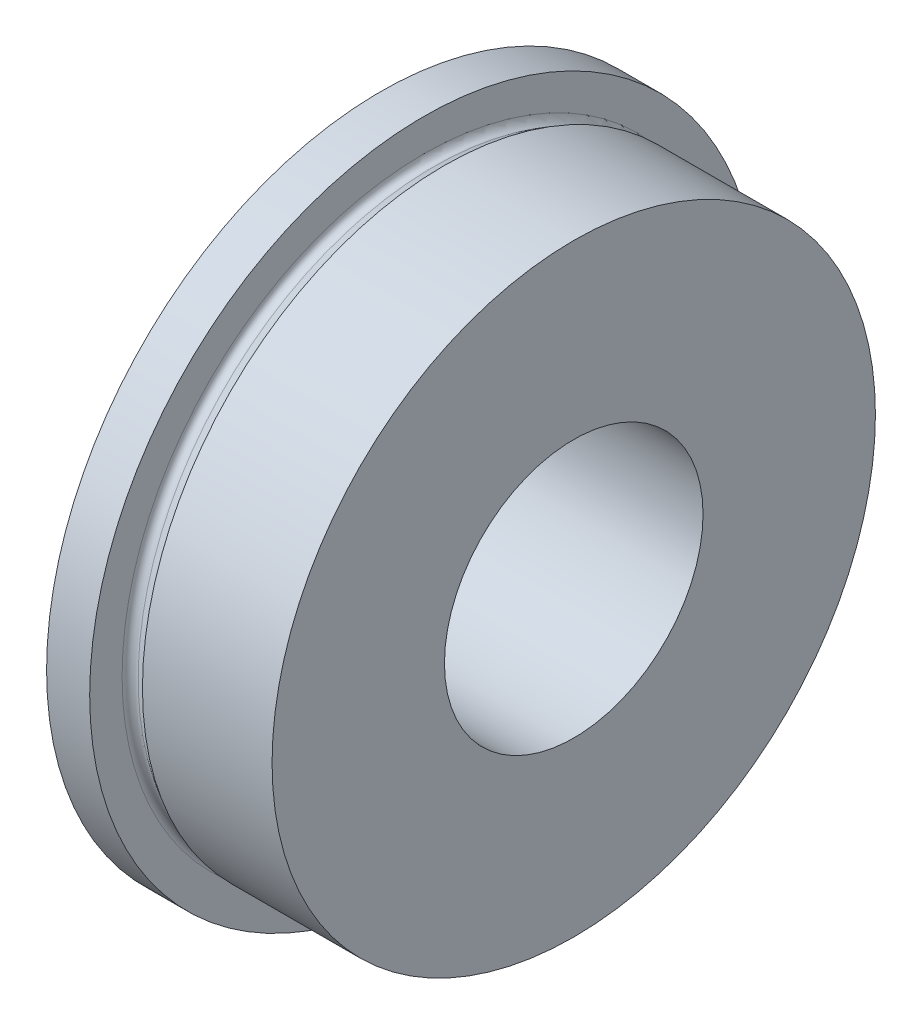
ISO-10303-21;
HEADER;
FILE_DESCRIPTION(('STEP AP214'),'2;1');
FILE_NAME('part.step','',(''),(''),'','','');
FILE_SCHEMA(('AUTOMOTIVE_DESIGN { 1 0 10303 214 1 1 1 1 }'));
ENDSEC;
DATA;
#1=APPLICATION_CONTEXT('core data for automotive mechanical design processes');
#2=APPLICATION_PROTOCOL_DEFINITION('international standard','automotive_design',2000,#1);
#3=PRODUCT_CONTEXT('',#1,'mechanical');
#4=PRODUCT('Part','Part','',(#3));
#5=PRODUCT_RELATED_PRODUCT_CATEGORY('part','',(#4));
#6=PRODUCT_DEFINITION_FORMATION('','',#4);
#7=PRODUCT_DEFINITION_CONTEXT('part definition',#1,'design');
#8=PRODUCT_DEFINITION('design','',#6,#7);
#9=PRODUCT_DEFINITION_SHAPE('','',#8);
#10=(LENGTH_UNIT() NAMED_UNIT(*) SI_UNIT(.MILLI.,.METRE.));
#11=(NAMED_UNIT(*) PLANE_ANGLE_UNIT() SI_UNIT($,.RADIAN.));
#12=(NAMED_UNIT(*) SI_UNIT($,.STERADIAN.) SOLID_ANGLE_UNIT());
#13=UNCERTAINTY_MEASURE_WITH_UNIT(LENGTH_MEASURE(1.E-05),#10,'distance_accuracy_value','');
#14=(GEOMETRIC_REPRESENTATION_CONTEXT(3) GLOBAL_UNCERTAINTY_ASSIGNED_CONTEXT((#13)) GLOBAL_UNIT_ASSIGNED_CONTEXT((#10,
#11,#12)) REPRESENTATION_CONTEXT('',''));
#15=CARTESIAN_POINT('',(0.,0.,0.));
#16=DIRECTION('',(0.,0.,1.));
#17=DIRECTION('',(1.,0.,0.));
#18=AXIS2_PLACEMENT_3D('',#15,#16,#17);
#19=CARTESIAN_POINT('',(0.,0.,0.));
#20=DIRECTION('',(-1.,0.,0.));
#21=DIRECTION('',(0.,0.,1.));
#22=AXIS2_PLACEMENT_3D('',#19,#20,#21);
#23=CYLINDRICAL_SURFACE('',#22,12.3063);
#24=CARTESIAN_POINT('',(0.,0.,0.));
#25=DIRECTION('',(-1.,0.,0.));
#26=DIRECTION('',(0.,0.,1.));
#27=AXIS2_PLACEMENT_3D('',#24,#25,#26);
#28=CIRCLE('',#27,12.3063);
#29=CARTESIAN_POINT('',(0.,0.,12.3063));
#30=VERTEX_POINT('',#29);
#31=EDGE_CURVE('E95',#30,#30,#28,.F.);
#32=ORIENTED_EDGE('',*,*,#31,.T.);
#33=EDGE_LOOP('',(#32));
#34=FACE_BOUND('',#33,.T.);
#35=CARTESIAN_POINT('',(1.5875,0.,0.));
#36=DIRECTION('',(-1.,0.,0.));
#37=DIRECTION('',(0.,0.,1.));
#38=AXIS2_PLACEMENT_3D('',#35,#36,#37);
#39=CIRCLE('',#38,12.3063);
#40=CARTESIAN_POINT('',(1.5875,0.,12.3063));
#41=VERTEX_POINT('',#40);
#42=EDGE_CURVE('E93',#41,#41,#39,.T.);
#43=ORIENTED_EDGE('',*,*,#42,.T.);
#44=EDGE_LOOP('',(#43));
#45=FACE_BOUND('',#44,.T.);
#46=ADVANCED_FACE('F16',(#34,#45),#23,.T.);
#47=CARTESIAN_POINT('',(0.,12.3063,0.));
#48=DIRECTION('',(1.,0.,0.));
#49=DIRECTION('',(0.,0.,-1.));
#50=AXIS2_PLACEMENT_3D('',#47,#48,#49);
#51=PLANE('',#50);
#52=ORIENTED_EDGE('',*,*,#31,.F.);
#53=EDGE_LOOP('',(#52));
#54=FACE_BOUND('',#53,.T.);
#55=CARTESIAN_POINT('',(0.,0.,0.));
#56=DIRECTION('',(-1.,0.,0.));
#57=DIRECTION('',(0.,0.,1.));
#58=AXIS2_PLACEMENT_3D('',#55,#56,#57);
#59=CIRCLE('',#58,9.906);
#60=CARTESIAN_POINT('',(0.,0.,9.906));
#61=VERTEX_POINT('',#60);
#62=EDGE_CURVE('E47',#61,#61,#59,.F.);
#63=ORIENTED_EDGE('',*,*,#62,.T.);
#64=EDGE_LOOP('',(#63));
#65=FACE_BOUND('',#64,.T.);
#66=ADVANCED_FACE('F65',(#54,#65),#51,.F.);
#67=CARTESIAN_POINT('',(1.5875,11.1125,0.));
#68=DIRECTION('',(-1.,0.,0.));
#69=DIRECTION('',(0.,0.,1.));
#70=AXIS2_PLACEMENT_3D('',#67,#68,#69);
#71=PLANE('',#70);
#72=CARTESIAN_POINT('',(1.5875,0.,0.));
#73=DIRECTION('',(1.,0.,0.));
#74=DIRECTION('',(0.,0.,1.));
#75=AXIS2_PLACEMENT_3D('',#72,#73,#74);
#76=CIRCLE('',#75,11.1125);
#77=CARTESIAN_POINT('',(1.5875,0.,-11.1125));
#78=VERTEX_POINT('',#77);
#79=CARTESIAN_POINT('',(1.5875,0.,11.1125));
#80=VERTEX_POINT('',#79);
#81=EDGE_CURVE('E33',#78,#80,#76,.F.);
#82=ORIENTED_EDGE('',*,*,#81,.T.);
#83=CARTESIAN_POINT('',(1.5875,0.,0.));
#84=DIRECTION('',(1.,0.,0.));
#85=DIRECTION('',(0.,0.,-1.));
#86=AXIS2_PLACEMENT_3D('',#83,#84,#85);
#87=CIRCLE('',#86,11.1125);
#88=EDGE_CURVE('E35',#80,#78,#87,.F.);
#89=ORIENTED_EDGE('',*,*,#88,.T.);
#90=EDGE_LOOP('',(#82,#89));
#91=FACE_BOUND('',#90,.T.);
#92=ORIENTED_EDGE('',*,*,#42,.F.);
#93=EDGE_LOOP('',(#92));
#94=FACE_BOUND('',#93,.T.);
#95=ADVANCED_FACE('F45',(#91,#94),#71,.F.);
#96=CARTESIAN_POINT('',(0.,0.,0.));
#97=DIRECTION('',(-1.,0.,0.));
#98=DIRECTION('',(0.,0.,1.));
#99=AXIS2_PLACEMENT_3D('',#96,#97,#98);
#100=CYLINDRICAL_SURFACE('',#99,9.906);
#101=CARTESIAN_POINT('',(0.381,0.,0.));
#102=DIRECTION('',(-1.,0.,0.));
#103=DIRECTION('',(0.,0.,1.));
#104=AXIS2_PLACEMENT_3D('',#101,#102,#103);
#105=CIRCLE('',#104,9.906);
#106=CARTESIAN_POINT('',(0.381,0.,9.906));
#107=VERTEX_POINT('',#106);
#108=EDGE_CURVE('E41',#107,#107,#105,.F.);
#109=ORIENTED_EDGE('',*,*,#108,.T.);
#110=EDGE_LOOP('',(#109));
#111=FACE_BOUND('',#110,.T.);
#112=ORIENTED_EDGE('',*,*,#62,.F.);
#113=EDGE_LOOP('',(#112));
#114=FACE_BOUND('',#113,.T.);
#115=ADVANCED_FACE('F64',(#111,#114),#100,.F.);
#116=CARTESIAN_POINT('',(0.381,9.906,0.));
#117=DIRECTION('',(1.,0.,0.));
#118=DIRECTION('',(0.,0.,-1.));
#119=AXIS2_PLACEMENT_3D('',#116,#117,#118);
#120=PLANE('',#119);
#121=ORIENTED_EDGE('',*,*,#108,.F.);
#122=EDGE_LOOP('',(#121));
#123=FACE_BOUND('',#122,.T.);
#124=CARTESIAN_POINT('',(0.381,0.,0.));
#125=DIRECTION('',(-1.,0.,0.));
#126=DIRECTION('',(0.,0.,1.));
#127=AXIS2_PLACEMENT_3D('',#124,#125,#126);
#128=CIRCLE('',#127,6.35);
#129=CARTESIAN_POINT('',(0.381,0.,6.35));
#130=VERTEX_POINT('',#129);
#131=EDGE_CURVE('E86',#130,#130,#128,.T.);
#132=ORIENTED_EDGE('',*,*,#131,.F.);
#133=EDGE_LOOP('',(#132));
#134=FACE_BOUND('',#133,.T.);
#135=ADVANCED_FACE('F106',(#123,#134),#120,.F.);
#136=CARTESIAN_POINT('',(1.8375,0.,0.));
#137=DIRECTION('',(-1.,0.,0.));
#138=DIRECTION('',(0.,0.,1.));
#139=AXIS2_PLACEMENT_3D('',#136,#137,#138);
#140=TOROIDAL_SURFACE('',#139,11.1125,0.250000000000001);
#141=ORIENTED_EDGE('',*,*,#88,.F.);
#142=ORIENTED_EDGE('',*,*,#81,.F.);
#143=EDGE_LOOP('',(#141,#142));
#144=FACE_BOUND('',#143,.T.);
#145=CARTESIAN_POINT('',(1.9625,0.,0.));
#146=DIRECTION('',(1.,0.,0.));
#147=DIRECTION('',(0.,0.,-1.));
#148=AXIS2_PLACEMENT_3D('',#145,#146,#147);
#149=CIRCLE('',#148,10.8959936490539);
#150=CARTESIAN_POINT('',(1.9625,0.,-10.8959936490539));
#151=VERTEX_POINT('',#150);
#152=EDGE_CURVE('E85',#151,#151,#149,.T.);
#153=ORIENTED_EDGE('',*,*,#152,.F.);
#154=EDGE_LOOP('',(#153));
#155=FACE_BOUND('',#154,.T.);
#156=ADVANCED_FACE('F37',(#144,#155),#140,.F.);
#157=CARTESIAN_POINT('',(0.,0.,0.));
#158=DIRECTION('',(-1.,0.,0.));
#159=DIRECTION('',(0.,0.,1.));
#160=AXIS2_PLACEMENT_3D('',#157,#158,#159);
#161=CYLINDRICAL_SURFACE('',#160,6.35);
#162=CARTESIAN_POINT('',(0.,0.,0.));
#163=DIRECTION('',(-1.,0.,0.));
#164=DIRECTION('',(0.,0.,1.));
#165=AXIS2_PLACEMENT_3D('',#162,#163,#164);
#166=CIRCLE('',#165,6.35);
#167=CARTESIAN_POINT('',(0.,0.,6.35));
#168=VERTEX_POINT('',#167);
#169=EDGE_CURVE('E82',#168,#168,#166,.F.);
#170=ORIENTED_EDGE('',*,*,#169,.T.);
#171=EDGE_LOOP('',(#170));
#172=FACE_BOUND('',#171,.T.);
#173=ORIENTED_EDGE('',*,*,#131,.T.);
#174=EDGE_LOOP('',(#173));
#175=FACE_BOUND('',#174,.T.);
#176=ADVANCED_FACE('F137',(#172,#175),#161,.T.);
#177=CARTESIAN_POINT('',(2.3375,0.,0.));
#178=DIRECTION('',(1.,0.,0.));
#179=DIRECTION('',(0.,0.,-1.));
#180=AXIS2_PLACEMENT_3D('',#177,#178,#179);
#181=CONICAL_SURFACE('',#180,11.1125,0.523598775598302);
#182=CARTESIAN_POINT('',(2.3375,0.,0.));
#183=DIRECTION('',(-1.,0.,0.));
#184=DIRECTION('',(0.,0.,1.));
#185=AXIS2_PLACEMENT_3D('',#182,#183,#184);
#186=CIRCLE('',#185,11.1125);
#187=CARTESIAN_POINT('',(2.3375,0.,11.1125));
#188=VERTEX_POINT('',#187);
#189=EDGE_CURVE('E81',#188,#188,#186,.F.);
#190=ORIENTED_EDGE('',*,*,#189,.F.);
#191=EDGE_LOOP('',(#190));
#192=FACE_BOUND('',#191,.T.);
#193=ORIENTED_EDGE('',*,*,#152,.T.);
#194=EDGE_LOOP('',(#193));
#195=FACE_BOUND('',#194,.T.);
#196=ADVANCED_FACE('F133',(#192,#195),#181,.T.);
#197=CARTESIAN_POINT('',(0.,6.35,0.));
#198=DIRECTION('',(1.,0.,0.));
#199=DIRECTION('',(0.,0.,-1.));
#200=AXIS2_PLACEMENT_3D('',#197,#198,#199);
#201=PLANE('',#200);
#202=ORIENTED_EDGE('',*,*,#169,.F.);
#203=EDGE_LOOP('',(#202));
#204=FACE_BOUND('',#203,.T.);
#205=CARTESIAN_POINT('',(0.,0.,0.));
#206=DIRECTION('',(-1.,0.,0.));
#207=DIRECTION('',(0.,0.,1.));
#208=AXIS2_PLACEMENT_3D('',#205,#206,#207);
#209=CIRCLE('',#208,4.7625);
#210=CARTESIAN_POINT('',(0.,0.,4.7625));
#211=VERTEX_POINT('',#210);
#212=EDGE_CURVE('E78',#211,#211,#209,.F.);
#213=ORIENTED_EDGE('',*,*,#212,.T.);
#214=EDGE_LOOP('',(#213));
#215=FACE_BOUND('',#214,.T.);
#216=ADVANCED_FACE('F129',(#204,#215),#201,.F.);
#217=CARTESIAN_POINT('',(0.,0.,0.));
#218=DIRECTION('',(-1.,0.,0.));
#219=DIRECTION('',(0.,0.,1.));
#220=AXIS2_PLACEMENT_3D('',#217,#218,#219);
#221=CYLINDRICAL_SURFACE('',#220,11.1125);
#222=ORIENTED_EDGE('',*,*,#189,.T.);
#223=EDGE_LOOP('',(#222));
#224=FACE_BOUND('',#223,.T.);
#225=CARTESIAN_POINT('',(7.112,0.,0.));
#226=DIRECTION('',(-1.,0.,0.));
#227=DIRECTION('',(0.,0.,1.));
#228=AXIS2_PLACEMENT_3D('',#225,#226,#227);
#229=CIRCLE('',#228,11.1125);
#230=CARTESIAN_POINT('',(7.112,0.,11.1125));
#231=VERTEX_POINT('',#230);
#232=EDGE_CURVE('E26',#231,#231,#229,.T.);
#233=ORIENTED_EDGE('',*,*,#232,.T.);
#234=EDGE_LOOP('',(#233));
#235=FACE_BOUND('',#234,.T.);
#236=ADVANCED_FACE('F121',(#224,#235),#221,.T.);
#237=CARTESIAN_POINT('',(0.,0.,0.));
#238=DIRECTION('',(-1.,0.,0.));
#239=DIRECTION('',(0.,0.,1.));
#240=AXIS2_PLACEMENT_3D('',#237,#238,#239);
#241=CYLINDRICAL_SURFACE('',#240,4.7625);
#242=CARTESIAN_POINT('',(7.112,0.,0.));
#243=DIRECTION('',(-1.,0.,0.));
#244=DIRECTION('',(0.,0.,1.));
#245=AXIS2_PLACEMENT_3D('',#242,#243,#244);
#246=CIRCLE('',#245,4.7625);
#247=CARTESIAN_POINT('',(7.112,0.,4.7625));
#248=VERTEX_POINT('',#247);
#249=EDGE_CURVE('E11',#248,#248,#246,.F.);
#250=ORIENTED_EDGE('',*,*,#249,.T.);
#251=EDGE_LOOP('',(#250));
#252=FACE_BOUND('',#251,.T.);
#253=ORIENTED_EDGE('',*,*,#212,.F.);
#254=EDGE_LOOP('',(#253));
#255=FACE_BOUND('',#254,.T.);
#256=ADVANCED_FACE('F115',(#252,#255),#241,.F.);
#257=CARTESIAN_POINT('',(7.112,4.7625,0.));
#258=DIRECTION('',(-1.,0.,0.));
#259=DIRECTION('',(0.,0.,1.));
#260=AXIS2_PLACEMENT_3D('',#257,#258,#259);
#261=PLANE('',#260);
#262=ORIENTED_EDGE('',*,*,#249,.F.);
#263=EDGE_LOOP('',(#262));
#264=FACE_BOUND('',#263,.T.);
#265=ORIENTED_EDGE('',*,*,#232,.F.);
#266=EDGE_LOOP('',(#265));
#267=FACE_BOUND('',#266,.T.);
#268=ADVANCED_FACE('F113',(#264,#267),#261,.F.);
#269=CLOSED_SHELL('',(#46,#66,#95,#115,#135,#156,#176,#196,#216,#236,#256,#268));
#270=MANIFOLD_SOLID_BREP('B1',#269);
#271=ADVANCED_BREP_SHAPE_REPRESENTATION('',(#18,#270),#14);
#272=SHAPE_DEFINITION_REPRESENTATION(#9,#271);
ENDSEC;
END-ISO-10303-21;
